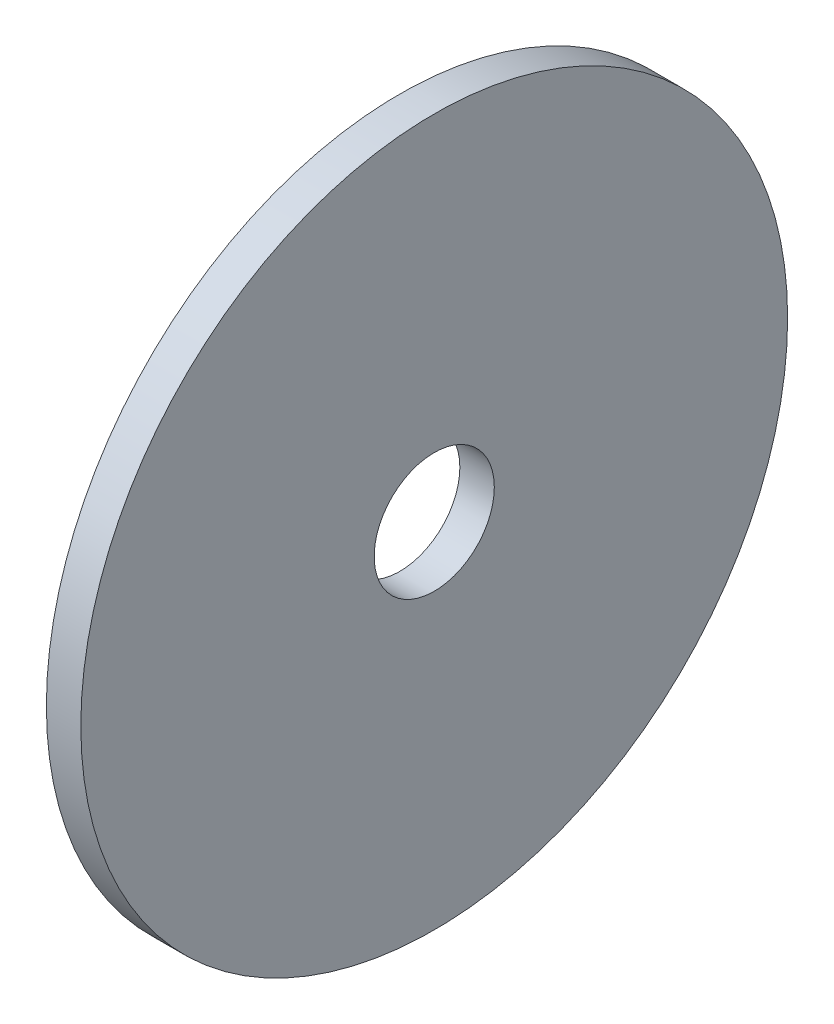
ISO-10303-21;
HEADER;
FILE_DESCRIPTION(('STEP AP214'),'2;1');
FILE_NAME('part.step','',(''),(''),'','','');
FILE_SCHEMA(('AUTOMOTIVE_DESIGN { 1 0 10303 214 1 1 1 1 }'));
ENDSEC;
DATA;
#1=APPLICATION_CONTEXT('core data for automotive mechanical design processes');
#2=APPLICATION_PROTOCOL_DEFINITION('international standard','automotive_design',2000,#1);
#3=PRODUCT_CONTEXT('',#1,'mechanical');
#4=PRODUCT('Part','Part','',(#3));
#5=PRODUCT_RELATED_PRODUCT_CATEGORY('part','',(#4));
#6=PRODUCT_DEFINITION_FORMATION('','',#4);
#7=PRODUCT_DEFINITION_CONTEXT('part definition',#1,'design');
#8=PRODUCT_DEFINITION('design','',#6,#7);
#9=PRODUCT_DEFINITION_SHAPE('','',#8);
#10=(LENGTH_UNIT() NAMED_UNIT(*) SI_UNIT(.MILLI.,.METRE.));
#11=(NAMED_UNIT(*) PLANE_ANGLE_UNIT() SI_UNIT($,.RADIAN.));
#12=(NAMED_UNIT(*) SI_UNIT($,.STERADIAN.) SOLID_ANGLE_UNIT());
#13=UNCERTAINTY_MEASURE_WITH_UNIT(LENGTH_MEASURE(1.E-05),#10,'distance_accuracy_value','');
#14=(GEOMETRIC_REPRESENTATION_CONTEXT(3) GLOBAL_UNCERTAINTY_ASSIGNED_CONTEXT((#13)) GLOBAL_UNIT_ASSIGNED_CONTEXT((#10,
#11,#12)) REPRESENTATION_CONTEXT('',''));
#15=CARTESIAN_POINT('',(0.,0.,0.));
#16=DIRECTION('',(0.,0.,1.));
#17=DIRECTION('',(1.,0.,0.));
#18=AXIS2_PLACEMENT_3D('',#15,#16,#17);
#19=CARTESIAN_POINT('',(547.878,0.,0.));
#20=DIRECTION('',(1.,0.,0.));
#21=DIRECTION('',(0.,0.,-1.));
#22=AXIS2_PLACEMENT_3D('',#19,#20,#21);
#23=PLANE('',#22);
#24=CARTESIAN_POINT('',(547.878,0.,0.));
#25=DIRECTION('',(1.,0.,0.));
#26=DIRECTION('',(0.,0.,-1.));
#27=AXIS2_PLACEMENT_3D('',#24,#25,#26);
#28=CIRCLE('',#27,9.525);
#29=CARTESIAN_POINT('',(547.878,0.,-9.525));
#30=VERTEX_POINT('',#29);
#31=EDGE_CURVE('E49',#30,#30,#28,.T.);
#32=ORIENTED_EDGE('',*,*,#31,.F.);
#33=EDGE_LOOP('',(#32));
#34=FACE_BOUND('',#33,.T.);
#35=CARTESIAN_POINT('',(547.878,0.,0.));
#36=DIRECTION('',(1.,0.,0.));
#37=DIRECTION('',(0.,0.,-1.));
#38=AXIS2_PLACEMENT_3D('',#35,#36,#37);
#39=CIRCLE('',#38,56.025884843362);
#40=CARTESIAN_POINT('',(547.878,0.,-56.025884843362));
#41=VERTEX_POINT('',#40);
#42=EDGE_CURVE('E60',#41,#41,#39,.T.);
#43=ORIENTED_EDGE('',*,*,#42,.T.);
#44=EDGE_LOOP('',(#43));
#45=FACE_BOUND('',#44,.T.);
#46=ADVANCED_FACE('F46',(#34,#45),#23,.T.);
#47=CARTESIAN_POINT('',(542.417,0.,0.));
#48=DIRECTION('',(1.,0.,0.));
#49=DIRECTION('',(0.,0.,-1.));
#50=AXIS2_PLACEMENT_3D('',#47,#48,#49);
#51=CYLINDRICAL_SURFACE('',#50,56.025884843362);
#52=CARTESIAN_POINT('',(542.417,0.,0.));
#53=DIRECTION('',(1.,0.,0.));
#54=DIRECTION('',(0.,0.,-1.));
#55=AXIS2_PLACEMENT_3D('',#52,#53,#54);
#56=CIRCLE('',#55,56.025884843362);
#57=CARTESIAN_POINT('',(542.417,0.,-56.025884843362));
#58=VERTEX_POINT('',#57);
#59=EDGE_CURVE('E58',#58,#58,#56,.T.);
#60=ORIENTED_EDGE('',*,*,#59,.T.);
#61=EDGE_LOOP('',(#60));
#62=FACE_BOUND('',#61,.T.);
#63=ORIENTED_EDGE('',*,*,#42,.F.);
#64=EDGE_LOOP('',(#63));
#65=FACE_BOUND('',#64,.T.);
#66=ADVANCED_FACE('F68',(#62,#65),#51,.T.);
#67=CARTESIAN_POINT('',(542.417,0.,0.));
#68=DIRECTION('',(1.,0.,0.));
#69=DIRECTION('',(0.,0.,-1.));
#70=AXIS2_PLACEMENT_3D('',#67,#68,#69);
#71=CYLINDRICAL_SURFACE('',#70,9.525);
#72=CARTESIAN_POINT('',(542.417,0.,0.));
#73=DIRECTION('',(1.,0.,0.));
#74=DIRECTION('',(0.,0.,-1.));
#75=AXIS2_PLACEMENT_3D('',#72,#73,#74);
#76=CIRCLE('',#75,9.525);
#77=CARTESIAN_POINT('',(542.417,0.,-9.525));
#78=VERTEX_POINT('',#77);
#79=EDGE_CURVE('E11',#78,#78,#76,.T.);
#80=ORIENTED_EDGE('',*,*,#79,.F.);
#81=EDGE_LOOP('',(#80));
#82=FACE_BOUND('',#81,.T.);
#83=ORIENTED_EDGE('',*,*,#31,.T.);
#84=EDGE_LOOP('',(#83));
#85=FACE_BOUND('',#84,.T.);
#86=ADVANCED_FACE('F73',(#82,#85),#71,.F.);
#87=CARTESIAN_POINT('',(542.417,0.,0.));
#88=DIRECTION('',(1.,0.,0.));
#89=DIRECTION('',(0.,0.,-1.));
#90=AXIS2_PLACEMENT_3D('',#87,#88,#89);
#91=PLANE('',#90);
#92=ORIENTED_EDGE('',*,*,#79,.T.);
#93=EDGE_LOOP('',(#92));
#94=FACE_BOUND('',#93,.T.);
#95=ORIENTED_EDGE('',*,*,#59,.F.);
#96=EDGE_LOOP('',(#95));
#97=FACE_BOUND('',#96,.T.);
#98=ADVANCED_FACE('F71',(#94,#97),#91,.F.);
#99=CLOSED_SHELL('',(#46,#66,#86,#98));
#100=MANIFOLD_SOLID_BREP('B2',#99);
#101=ADVANCED_BREP_SHAPE_REPRESENTATION('',(#18,#100),#14);
#102=SHAPE_DEFINITION_REPRESENTATION(#9,#101);
ENDSEC;
END-ISO-10303-21;
